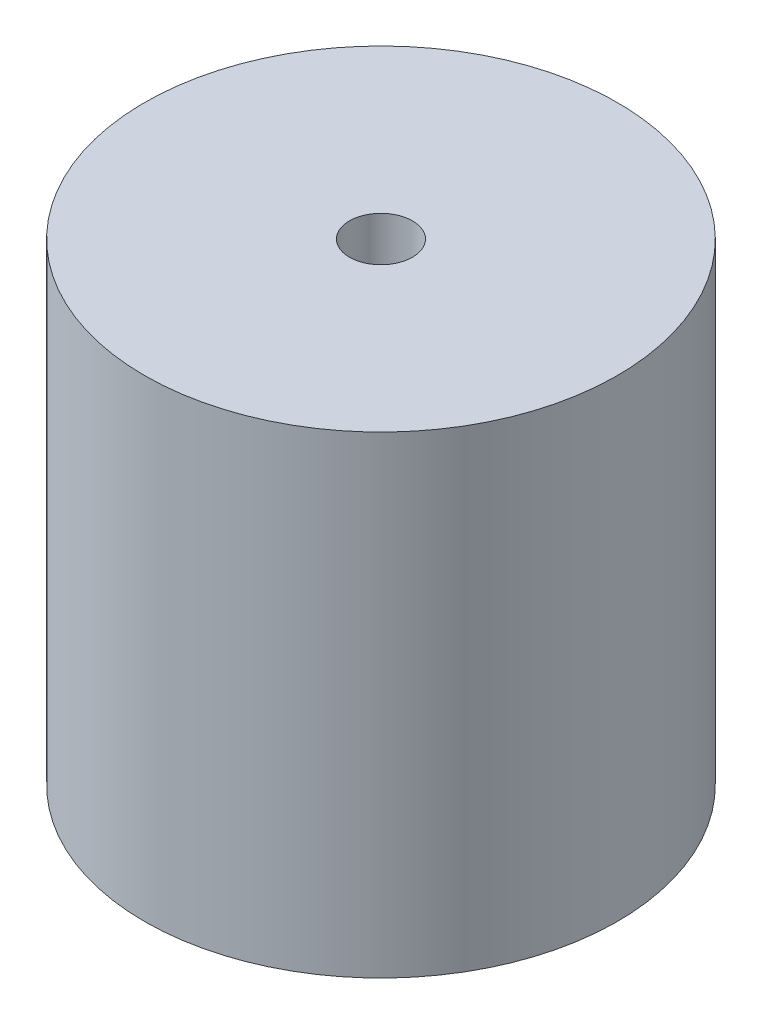
ISO-10303-21;
HEADER;
FILE_DESCRIPTION(('STEP AP214'),'2;1');
FILE_NAME('part.step','',(''),(''),'','','');
FILE_SCHEMA(('AUTOMOTIVE_DESIGN { 1 0 10303 214 1 1 1 1 }'));
ENDSEC;
DATA;
#1=APPLICATION_CONTEXT('core data for automotive mechanical design processes');
#2=APPLICATION_PROTOCOL_DEFINITION('international standard','automotive_design',2000,#1);
#3=PRODUCT_CONTEXT('',#1,'mechanical');
#4=PRODUCT('Part','Part','',(#3));
#5=PRODUCT_RELATED_PRODUCT_CATEGORY('part','',(#4));
#6=PRODUCT_DEFINITION_FORMATION('','',#4);
#7=PRODUCT_DEFINITION_CONTEXT('part definition',#1,'design');
#8=PRODUCT_DEFINITION('design','',#6,#7);
#9=PRODUCT_DEFINITION_SHAPE('','',#8);
#10=(LENGTH_UNIT() NAMED_UNIT(*) SI_UNIT(.MILLI.,.METRE.));
#11=(NAMED_UNIT(*) PLANE_ANGLE_UNIT() SI_UNIT($,.RADIAN.));
#12=(NAMED_UNIT(*) SI_UNIT($,.STERADIAN.) SOLID_ANGLE_UNIT());
#13=UNCERTAINTY_MEASURE_WITH_UNIT(LENGTH_MEASURE(1.E-05),#10,'distance_accuracy_value','');
#14=(GEOMETRIC_REPRESENTATION_CONTEXT(3) GLOBAL_UNCERTAINTY_ASSIGNED_CONTEXT((#13)) GLOBAL_UNIT_ASSIGNED_CONTEXT((#10,
#11,#12)) REPRESENTATION_CONTEXT('',''));
#15=CARTESIAN_POINT('',(0.,0.,0.));
#16=DIRECTION('',(0.,0.,1.));
#17=DIRECTION('',(1.,0.,0.));
#18=AXIS2_PLACEMENT_3D('',#15,#16,#17);
#19=CARTESIAN_POINT('',(0.,30.,0.));
#20=DIRECTION('',(0.,-1.,0.));
#21=DIRECTION('',(0.,0.,-1.));
#22=AXIS2_PLACEMENT_3D('',#19,#20,#21);
#23=CYLINDRICAL_SURFACE('',#22,15.);
#24=CARTESIAN_POINT('',(0.,30.,0.));
#25=DIRECTION('',(0.,1.,0.));
#26=DIRECTION('',(0.,0.,1.));
#27=AXIS2_PLACEMENT_3D('',#24,#25,#26);
#28=CIRCLE('',#27,15.);
#29=CARTESIAN_POINT('',(0.,30.,15.));
#30=VERTEX_POINT('',#29);
#31=EDGE_CURVE('E10',#30,#30,#28,.T.);
#32=ORIENTED_EDGE('',*,*,#31,.F.);
#33=EDGE_LOOP('',(#32));
#34=FACE_BOUND('',#33,.T.);
#35=CARTESIAN_POINT('',(0.,0.,0.));
#36=DIRECTION('',(0.,1.,0.));
#37=DIRECTION('',(0.,0.,1.));
#38=AXIS2_PLACEMENT_3D('',#35,#36,#37);
#39=CIRCLE('',#38,15.);
#40=CARTESIAN_POINT('',(0.,0.,15.));
#41=VERTEX_POINT('',#40);
#42=EDGE_CURVE('E34',#41,#41,#39,.T.);
#43=ORIENTED_EDGE('',*,*,#42,.T.);
#44=EDGE_LOOP('',(#43));
#45=FACE_BOUND('',#44,.T.);
#46=ADVANCED_FACE('F31',(#34,#45),#23,.T.);
#47=CARTESIAN_POINT('',(0.,30.,0.));
#48=DIRECTION('',(0.,1.,0.));
#49=DIRECTION('',(0.,0.,1.));
#50=AXIS2_PLACEMENT_3D('',#47,#48,#49);
#51=PLANE('',#50);
#52=CARTESIAN_POINT('',(0.,30.,0.));
#53=DIRECTION('',(0.,1.,0.));
#54=DIRECTION('',(0.,0.,1.));
#55=AXIS2_PLACEMENT_3D('',#52,#53,#54);
#56=CIRCLE('',#55,2.);
#57=CARTESIAN_POINT('',(0.,30.,2.));
#58=VERTEX_POINT('',#57);
#59=EDGE_CURVE('E41',#58,#58,#56,.T.);
#60=ORIENTED_EDGE('',*,*,#59,.F.);
#61=EDGE_LOOP('',(#60));
#62=FACE_BOUND('',#61,.T.);
#63=ORIENTED_EDGE('',*,*,#31,.T.);
#64=EDGE_LOOP('',(#63));
#65=FACE_BOUND('',#64,.T.);
#66=ADVANCED_FACE('F52',(#62,#65),#51,.T.);
#67=CARTESIAN_POINT('',(0.,0.,0.));
#68=DIRECTION('',(0.,1.,0.));
#69=DIRECTION('',(0.,0.,1.));
#70=AXIS2_PLACEMENT_3D('',#67,#68,#69);
#71=PLANE('',#70);
#72=CARTESIAN_POINT('',(0.,0.,0.));
#73=DIRECTION('',(0.,1.,0.));
#74=DIRECTION('',(0.,0.,1.));
#75=AXIS2_PLACEMENT_3D('',#72,#73,#74);
#76=CIRCLE('',#75,2.);
#77=CARTESIAN_POINT('',(0.,0.,2.));
#78=VERTEX_POINT('',#77);
#79=EDGE_CURVE('E43',#78,#78,#76,.T.);
#80=ORIENTED_EDGE('',*,*,#79,.T.);
#81=EDGE_LOOP('',(#80));
#82=FACE_BOUND('',#81,.T.);
#83=ORIENTED_EDGE('',*,*,#42,.F.);
#84=EDGE_LOOP('',(#83));
#85=FACE_BOUND('',#84,.T.);
#86=ADVANCED_FACE('F54',(#82,#85),#71,.F.);
#87=CARTESIAN_POINT('',(0.,30.,0.));
#88=DIRECTION('',(0.,-1.,0.));
#89=DIRECTION('',(0.,0.,-1.));
#90=AXIS2_PLACEMENT_3D('',#87,#88,#89);
#91=CYLINDRICAL_SURFACE('',#90,2.);
#92=ORIENTED_EDGE('',*,*,#59,.T.);
#93=EDGE_LOOP('',(#92));
#94=FACE_BOUND('',#93,.T.);
#95=ORIENTED_EDGE('',*,*,#79,.F.);
#96=EDGE_LOOP('',(#95));
#97=FACE_BOUND('',#96,.T.);
#98=ADVANCED_FACE('F49',(#94,#97),#91,.F.);
#99=CLOSED_SHELL('',(#46,#66,#86,#98));
#100=MANIFOLD_SOLID_BREP('B2',#99);
#101=ADVANCED_BREP_SHAPE_REPRESENTATION('',(#18,#100),#14);
#102=SHAPE_DEFINITION_REPRESENTATION(#9,#101);
ENDSEC;
END-ISO-10303-21;
